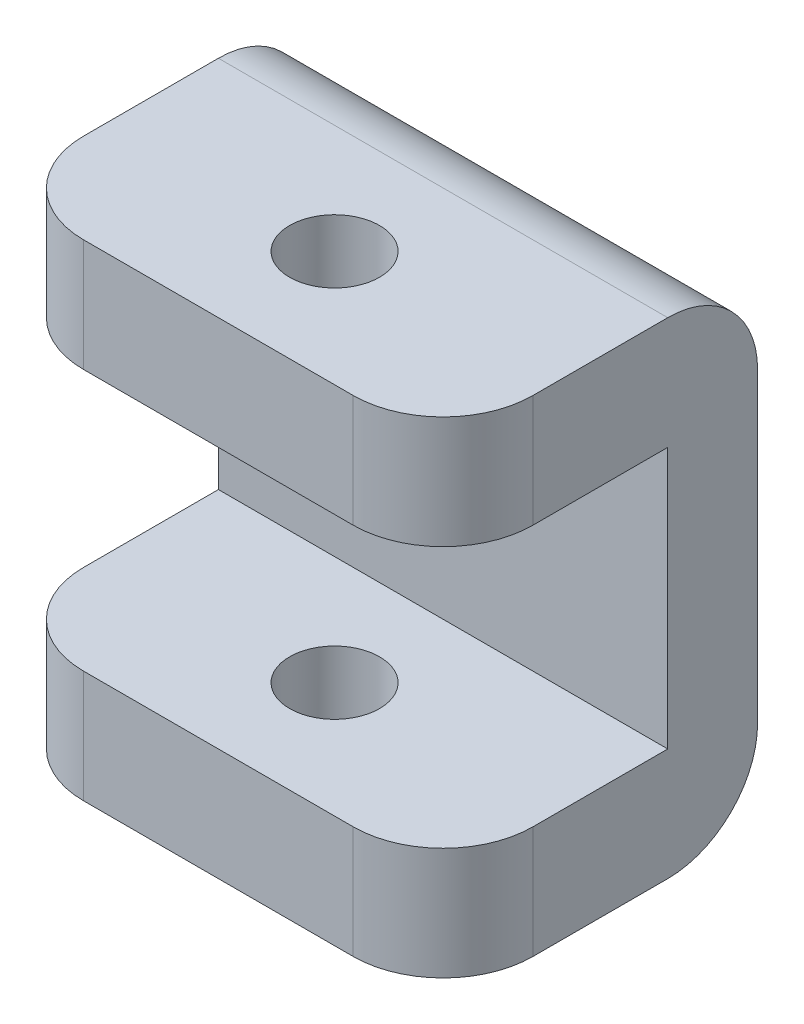
ISO-10303-21;
HEADER;
FILE_DESCRIPTION(('STEP AP214'),'2;1');
FILE_NAME('part.step','',(''),(''),'','','');
FILE_SCHEMA(('AUTOMOTIVE_DESIGN { 1 0 10303 214 1 1 1 1 }'));
ENDSEC;
DATA;
#1=APPLICATION_CONTEXT('core data for automotive mechanical design processes');
#2=APPLICATION_PROTOCOL_DEFINITION('international standard','automotive_design',2000,#1);
#3=PRODUCT_CONTEXT('',#1,'mechanical');
#4=PRODUCT('Part','Part','',(#3));
#5=PRODUCT_RELATED_PRODUCT_CATEGORY('part','',(#4));
#6=PRODUCT_DEFINITION_FORMATION('','',#4);
#7=PRODUCT_DEFINITION_CONTEXT('part definition',#1,'design');
#8=PRODUCT_DEFINITION('design','',#6,#7);
#9=PRODUCT_DEFINITION_SHAPE('','',#8);
#10=(LENGTH_UNIT() NAMED_UNIT(*) SI_UNIT(.MILLI.,.METRE.));
#11=(NAMED_UNIT(*) PLANE_ANGLE_UNIT() SI_UNIT($,.RADIAN.));
#12=(NAMED_UNIT(*) SI_UNIT($,.STERADIAN.) SOLID_ANGLE_UNIT());
#13=UNCERTAINTY_MEASURE_WITH_UNIT(LENGTH_MEASURE(1.E-05),#10,'distance_accuracy_value','');
#14=(GEOMETRIC_REPRESENTATION_CONTEXT(3) GLOBAL_UNCERTAINTY_ASSIGNED_CONTEXT((#13)) GLOBAL_UNIT_ASSIGNED_CONTEXT((#10,
#11,#12)) REPRESENTATION_CONTEXT('',''));
#15=CARTESIAN_POINT('',(0.,0.,0.));
#16=DIRECTION('',(0.,0.,1.));
#17=DIRECTION('',(1.,0.,0.));
#18=AXIS2_PLACEMENT_3D('',#15,#16,#17);
#19=CARTESIAN_POINT('',(0.,0.,2.));
#20=DIRECTION('',(0.,0.,1.));
#21=DIRECTION('',(1.,0.,0.));
#22=AXIS2_PLACEMENT_3D('',#19,#20,#21);
#23=PLANE('',#22);
#24=DIRECTION('',(0.,-1.,0.));
#25=VECTOR('',#24,1.);
#26=CARTESIAN_POINT('',(-8.33333333333333,3.93115942028985,2.));
#27=LINE('',#26,#25);
#28=CARTESIAN_POINT('',(-8.33333333333333,1.43115942028985,2.));
#29=VERTEX_POINT('',#28);
#30=CARTESIAN_POINT('',(-8.33333333333333,-4.38184057971015,2.));
#31=VERTEX_POINT('',#30);
#32=EDGE_CURVE('E164',#29,#31,#27,.T.);
#33=ORIENTED_EDGE('',*,*,#32,.T.);
#34=DIRECTION('',(-1.,0.,0.));
#35=VECTOR('',#34,1.);
#36=CARTESIAN_POINT('',(1.66666666666667,-4.38184057971015,2.));
#37=LINE('',#36,#35);
#38=CARTESIAN_POINT('',(1.66666666666667,-4.38184057971015,2.));
#39=VERTEX_POINT('',#38);
#40=EDGE_CURVE('E161',#39,#31,#37,.T.);
#41=ORIENTED_EDGE('',*,*,#40,.F.);
#42=DIRECTION('',(0.,1.,0.));
#43=VECTOR('',#42,1.);
#44=CARTESIAN_POINT('',(1.66666666666667,3.93115942028985,2.));
#45=LINE('',#44,#43);
#46=CARTESIAN_POINT('',(1.66666666666667,1.43115942028985,2.));
#47=VERTEX_POINT('',#46);
#48=EDGE_CURVE('E145',#39,#47,#45,.T.);
#49=ORIENTED_EDGE('',*,*,#48,.T.);
#50=DIRECTION('',(1.,0.,0.));
#51=VECTOR('',#50,1.);
#52=CARTESIAN_POINT('',(-8.33333333333333,1.43115942028985,2.));
#53=LINE('',#52,#51);
#54=EDGE_CURVE('E158',#29,#47,#53,.T.);
#55=ORIENTED_EDGE('',*,*,#54,.F.);
#56=EDGE_LOOP('',(#33,#41,#49,#55));
#57=FACE_BOUND('',#56,.T.);
#58=ADVANCED_FACE('F39',(#57),#23,.T.);
#59=CARTESIAN_POINT('',(-8.33333333333333,3.93115942028985,2.));
#60=DIRECTION('',(1.,0.,0.));
#61=DIRECTION('',(0.,1.,0.));
#62=AXIS2_PLACEMENT_3D('',#59,#60,#61);
#63=PLANE('',#62);
#64=DIRECTION('',(0.,-1.,0.));
#65=VECTOR('',#64,1.);
#66=CARTESIAN_POINT('',(-8.33333333333333,3.93115942028985,0.));
#67=LINE('',#66,#65);
#68=CARTESIAN_POINT('',(-8.33333333333333,1.93115942028985,0.));
#69=VERTEX_POINT('',#68);
#70=CARTESIAN_POINT('',(-8.33333333333333,-4.88184057971015,0.));
#71=VERTEX_POINT('',#70);
#72=EDGE_CURVE('E181',#69,#71,#67,.T.);
#73=ORIENTED_EDGE('',*,*,#72,.T.);
#74=CARTESIAN_POINT('',(-8.33333333333333,-4.88184057971015,2.));
#75=DIRECTION('',(1.,0.,0.));
#76=DIRECTION('',(0.,1.,0.));
#77=AXIS2_PLACEMENT_3D('',#74,#75,#76);
#78=CIRCLE('',#77,2.);
#79=CARTESIAN_POINT('',(-8.33333333333333,-6.88184057971015,2.));
#80=VERTEX_POINT('',#79);
#81=EDGE_CURVE('E247',#71,#80,#78,.F.);
#82=ORIENTED_EDGE('',*,*,#81,.T.);
#83=DIRECTION('',(0.,0.,-1.));
#84=VECTOR('',#83,1.);
#85=CARTESIAN_POINT('',(-8.33333333333333,-6.88184057971015,2.));
#86=LINE('',#85,#84);
#87=CARTESIAN_POINT('',(-8.33333333333333,-6.88184057971015,5.));
#88=VERTEX_POINT('',#87);
#89=EDGE_CURVE('E201',#88,#80,#86,.T.);
#90=ORIENTED_EDGE('',*,*,#89,.F.);
#91=DIRECTION('',(0.,-1.,0.));
#92=VECTOR('',#91,1.);
#93=CARTESIAN_POINT('',(-8.33333333333333,-4.38184057971015,5.));
#94=LINE('',#93,#92);
#95=CARTESIAN_POINT('',(-8.33333333333333,-4.38184057971015,5.));
#96=VERTEX_POINT('',#95);
#97=EDGE_CURVE('E241',#88,#96,#94,.F.);
#98=ORIENTED_EDGE('',*,*,#97,.T.);
#99=DIRECTION('',(0.,0.,-1.));
#100=VECTOR('',#99,1.);
#101=CARTESIAN_POINT('',(-8.33333333333333,-4.38184057971015,7.));
#102=LINE('',#101,#100);
#103=EDGE_CURVE('E175',#96,#31,#102,.T.);
#104=ORIENTED_EDGE('',*,*,#103,.T.);
#105=ORIENTED_EDGE('',*,*,#32,.F.);
#106=DIRECTION('',(0.,0.,-1.));
#107=VECTOR('',#106,1.);
#108=CARTESIAN_POINT('',(-8.33333333333333,1.43115942028985,7.));
#109=LINE('',#108,#107);
#110=CARTESIAN_POINT('',(-8.33333333333333,1.43115942028985,5.));
#111=VERTEX_POINT('',#110);
#112=EDGE_CURVE('E151',#111,#29,#109,.T.);
#113=ORIENTED_EDGE('',*,*,#112,.F.);
#114=DIRECTION('',(0.,-1.,0.));
#115=VECTOR('',#114,1.);
#116=CARTESIAN_POINT('',(-8.33333333333333,3.93115942028985,5.));
#117=LINE('',#116,#115);
#118=CARTESIAN_POINT('',(-8.33333333333333,3.93115942028985,5.));
#119=VERTEX_POINT('',#118);
#120=EDGE_CURVE('E238',#111,#119,#117,.F.);
#121=ORIENTED_EDGE('',*,*,#120,.T.);
#122=DIRECTION('',(0.,0.,-1.));
#123=VECTOR('',#122,1.);
#124=CARTESIAN_POINT('',(-8.33333333333333,3.93115942028985,2.));
#125=LINE('',#124,#123);
#126=CARTESIAN_POINT('',(-8.33333333333333,3.93115942028985,2.));
#127=VERTEX_POINT('',#126);
#128=EDGE_CURVE('E163',#119,#127,#125,.T.);
#129=ORIENTED_EDGE('',*,*,#128,.T.);
#130=CARTESIAN_POINT('',(-8.33333333333333,1.93115942028985,2.));
#131=DIRECTION('',(1.,0.,0.));
#132=DIRECTION('',(0.,1.,0.));
#133=AXIS2_PLACEMENT_3D('',#130,#131,#132);
#134=CIRCLE('',#133,2.);
#135=EDGE_CURVE('E244',#127,#69,#134,.F.);
#136=ORIENTED_EDGE('',*,*,#135,.T.);
#137=EDGE_LOOP('',(#73,#82,#90,#98,#104,#105,#113,#121,#129,#136));
#138=FACE_BOUND('',#137,.T.);
#139=ADVANCED_FACE('F282',(#138),#63,.F.);
#140=CARTESIAN_POINT('',(-8.33333333333333,-6.88184057971015,2.));
#141=DIRECTION('',(0.,1.,0.));
#142=DIRECTION('',(0.,0.,1.));
#143=AXIS2_PLACEMENT_3D('',#140,#141,#142);
#144=PLANE('',#143);
#145=CARTESIAN_POINT('',(-3.31858433429488,-6.88184057971015,4.43));
#146=DIRECTION('',(0.,1.,0.));
#147=DIRECTION('',(0.,0.,1.));
#148=AXIS2_PLACEMENT_3D('',#145,#146,#147);
#149=CIRCLE('',#148,1.);
#150=CARTESIAN_POINT('',(-3.31858433429488,-6.88184057971015,5.43));
#151=VERTEX_POINT('',#150);
#152=EDGE_CURVE('E211',#151,#151,#149,.T.);
#153=ORIENTED_EDGE('',*,*,#152,.T.);
#154=EDGE_LOOP('',(#153));
#155=FACE_BOUND('',#154,.T.);
#156=ORIENTED_EDGE('',*,*,#89,.T.);
#157=DIRECTION('',(1.,0.,0.));
#158=VECTOR('',#157,1.);
#159=CARTESIAN_POINT('',(-8.33333333333333,-6.88184057971015,2.));
#160=LINE('',#159,#158);
#161=CARTESIAN_POINT('',(1.66666666666667,-6.88184057971015,2.));
#162=VERTEX_POINT('',#161);
#163=EDGE_CURVE('E217',#80,#162,#160,.T.);
#164=ORIENTED_EDGE('',*,*,#163,.T.);
#165=DIRECTION('',(0.,0.,-1.));
#166=VECTOR('',#165,1.);
#167=CARTESIAN_POINT('',(1.66666666666667,-6.88184057971015,2.));
#168=LINE('',#167,#166);
#169=CARTESIAN_POINT('',(1.66666666666667,-6.88184057971015,5.));
#170=VERTEX_POINT('',#169);
#171=EDGE_CURVE('E198',#170,#162,#168,.T.);
#172=ORIENTED_EDGE('',*,*,#171,.F.);
#173=CARTESIAN_POINT('',(-0.333333333333331,-6.88184057971015,5.));
#174=DIRECTION('',(0.,1.,0.));
#175=DIRECTION('',(0.,0.,1.));
#176=AXIS2_PLACEMENT_3D('',#173,#174,#175);
#177=CIRCLE('',#176,2.);
#178=CARTESIAN_POINT('',(-0.333333333333331,-6.88184057971015,7.));
#179=VERTEX_POINT('',#178);
#180=EDGE_CURVE('E205',#170,#179,#177,.F.);
#181=ORIENTED_EDGE('',*,*,#180,.T.);
#182=DIRECTION('',(1.,0.,0.));
#183=VECTOR('',#182,1.);
#184=CARTESIAN_POINT('',(1.66666666666667,-6.88184057971015,7.));
#185=LINE('',#184,#183);
#186=CARTESIAN_POINT('',(-6.33333333333333,-6.88184057971015,7.));
#187=VERTEX_POINT('',#186);
#188=EDGE_CURVE('E316',#187,#179,#185,.T.);
#189=ORIENTED_EDGE('',*,*,#188,.F.);
#190=CARTESIAN_POINT('',(-6.33333333333333,-6.88184057971015,5.));
#191=DIRECTION('',(0.,1.,0.));
#192=DIRECTION('',(0.,0.,1.));
#193=AXIS2_PLACEMENT_3D('',#190,#191,#192);
#194=CIRCLE('',#193,2.);
#195=EDGE_CURVE('E214',#187,#88,#194,.F.);
#196=ORIENTED_EDGE('',*,*,#195,.T.);
#197=EDGE_LOOP('',(#156,#164,#172,#181,#189,#196));
#198=FACE_BOUND('',#197,.T.);
#199=ADVANCED_FACE('F312',(#155,#198),#144,.F.);
#200=CARTESIAN_POINT('',(1.66666666666667,3.93115942028985,2.));
#201=DIRECTION('',(-1.,0.,0.));
#202=DIRECTION('',(0.,-1.,0.));
#203=AXIS2_PLACEMENT_3D('',#200,#201,#202);
#204=PLANE('',#203);
#205=ORIENTED_EDGE('',*,*,#171,.T.);
#206=CARTESIAN_POINT('',(1.66666666666667,-4.88184057971015,2.));
#207=DIRECTION('',(-1.,0.,0.));
#208=DIRECTION('',(0.,-1.,0.));
#209=AXIS2_PLACEMENT_3D('',#206,#207,#208);
#210=CIRCLE('',#209,2.);
#211=CARTESIAN_POINT('',(1.66666666666667,-4.88184057971015,0.));
#212=VERTEX_POINT('',#211);
#213=EDGE_CURVE('E229',#162,#212,#210,.F.);
#214=ORIENTED_EDGE('',*,*,#213,.T.);
#215=DIRECTION('',(0.,1.,0.));
#216=VECTOR('',#215,1.);
#217=CARTESIAN_POINT('',(1.66666666666667,3.93115942028985,0.));
#218=LINE('',#217,#216);
#219=CARTESIAN_POINT('',(1.66666666666667,1.93115942028985,0.));
#220=VERTEX_POINT('',#219);
#221=EDGE_CURVE('E183',#212,#220,#218,.T.);
#222=ORIENTED_EDGE('',*,*,#221,.T.);
#223=CARTESIAN_POINT('',(1.66666666666667,1.93115942028985,2.));
#224=DIRECTION('',(-1.,0.,0.));
#225=DIRECTION('',(0.,-1.,0.));
#226=AXIS2_PLACEMENT_3D('',#223,#224,#225);
#227=CIRCLE('',#226,2.);
#228=CARTESIAN_POINT('',(1.66666666666667,3.93115942028985,2.));
#229=VERTEX_POINT('',#228);
#230=EDGE_CURVE('E226',#220,#229,#227,.F.);
#231=ORIENTED_EDGE('',*,*,#230,.T.);
#232=DIRECTION('',(0.,0.,-1.));
#233=VECTOR('',#232,1.);
#234=CARTESIAN_POINT('',(1.66666666666667,3.93115942028985,2.));
#235=LINE('',#234,#233);
#236=CARTESIAN_POINT('',(1.66666666666667,3.93115942028985,5.));
#237=VERTEX_POINT('',#236);
#238=EDGE_CURVE('E194',#237,#229,#235,.T.);
#239=ORIENTED_EDGE('',*,*,#238,.F.);
#240=DIRECTION('',(0.,1.,0.));
#241=VECTOR('',#240,1.);
#242=CARTESIAN_POINT('',(1.66666666666667,1.43115942028985,5.));
#243=LINE('',#242,#241);
#244=CARTESIAN_POINT('',(1.66666666666667,1.43115942028985,5.));
#245=VERTEX_POINT('',#244);
#246=EDGE_CURVE('E148',#237,#245,#243,.F.);
#247=ORIENTED_EDGE('',*,*,#246,.T.);
#248=DIRECTION('',(0.,0.,-1.));
#249=VECTOR('',#248,1.);
#250=CARTESIAN_POINT('',(1.66666666666667,1.43115942028985,7.));
#251=LINE('',#250,#249);
#252=EDGE_CURVE('E140',#245,#47,#251,.T.);
#253=ORIENTED_EDGE('',*,*,#252,.T.);
#254=ORIENTED_EDGE('',*,*,#48,.F.);
#255=DIRECTION('',(0.,0.,-1.));
#256=VECTOR('',#255,1.);
#257=CARTESIAN_POINT('',(1.66666666666667,-4.38184057971015,7.));
#258=LINE('',#257,#256);
#259=CARTESIAN_POINT('',(1.66666666666667,-4.38184057971015,5.));
#260=VERTEX_POINT('',#259);
#261=EDGE_CURVE('E170',#260,#39,#258,.T.);
#262=ORIENTED_EDGE('',*,*,#261,.F.);
#263=DIRECTION('',(0.,1.,0.));
#264=VECTOR('',#263,1.);
#265=CARTESIAN_POINT('',(1.66666666666667,-6.88184057971015,5.));
#266=LINE('',#265,#264);
#267=EDGE_CURVE('E223',#260,#170,#266,.F.);
#268=ORIENTED_EDGE('',*,*,#267,.T.);
#269=EDGE_LOOP('',(#205,#214,#222,#231,#239,#247,#253,#254,#262,#268));
#270=FACE_BOUND('',#269,.T.);
#271=ADVANCED_FACE('F143',(#270),#204,.F.);
#272=CARTESIAN_POINT('',(-8.33333333333333,3.93115942028985,2.));
#273=DIRECTION('',(0.,-1.,0.));
#274=DIRECTION('',(0.,0.,-1.));
#275=AXIS2_PLACEMENT_3D('',#272,#273,#274);
#276=PLANE('',#275);
#277=CARTESIAN_POINT('',(-3.31858433429488,3.93115942028985,4.43));
#278=DIRECTION('',(0.,1.,0.));
#279=DIRECTION('',(0.,0.,1.));
#280=AXIS2_PLACEMENT_3D('',#277,#278,#279);
#281=CIRCLE('',#280,1.);
#282=CARTESIAN_POINT('',(-3.31858433429488,3.93115942028985,5.43));
#283=VERTEX_POINT('',#282);
#284=EDGE_CURVE('E518',#283,#283,#281,.T.);
#285=ORIENTED_EDGE('',*,*,#284,.F.);
#286=EDGE_LOOP('',(#285));
#287=FACE_BOUND('',#286,.T.);
#288=ORIENTED_EDGE('',*,*,#238,.T.);
#289=DIRECTION('',(-1.,0.,0.));
#290=VECTOR('',#289,1.);
#291=CARTESIAN_POINT('',(-8.33333333333333,3.93115942028985,2.));
#292=LINE('',#291,#290);
#293=EDGE_CURVE('E256',#229,#127,#292,.T.);
#294=ORIENTED_EDGE('',*,*,#293,.T.);
#295=ORIENTED_EDGE('',*,*,#128,.F.);
#296=CARTESIAN_POINT('',(-6.33333333333333,3.93115942028985,5.));
#297=DIRECTION('',(0.,-1.,0.));
#298=DIRECTION('',(0.,0.,-1.));
#299=AXIS2_PLACEMENT_3D('',#296,#297,#298);
#300=CIRCLE('',#299,2.);
#301=CARTESIAN_POINT('',(-6.33333333333333,3.93115942028985,7.));
#302=VERTEX_POINT('',#301);
#303=EDGE_CURVE('E250',#119,#302,#300,.F.);
#304=ORIENTED_EDGE('',*,*,#303,.T.);
#305=DIRECTION('',(-1.,0.,0.));
#306=VECTOR('',#305,1.);
#307=CARTESIAN_POINT('',(-8.33333333333333,3.93115942028985,7.));
#308=LINE('',#307,#306);
#309=CARTESIAN_POINT('',(-0.333333333333335,3.93115942028985,7.));
#310=VERTEX_POINT('',#309);
#311=EDGE_CURVE('E152',#310,#302,#308,.T.);
#312=ORIENTED_EDGE('',*,*,#311,.F.);
#313=CARTESIAN_POINT('',(-0.333333333333334,3.93115942028985,5.));
#314=DIRECTION('',(0.,-1.,0.));
#315=DIRECTION('',(0.,0.,-1.));
#316=AXIS2_PLACEMENT_3D('',#313,#314,#315);
#317=CIRCLE('',#316,2.);
#318=EDGE_CURVE('E253',#310,#237,#317,.F.);
#319=ORIENTED_EDGE('',*,*,#318,.T.);
#320=EDGE_LOOP('',(#288,#294,#295,#304,#312,#319));
#321=FACE_BOUND('',#320,.T.);
#322=ADVANCED_FACE('F288',(#287,#321),#276,.F.);
#323=CARTESIAN_POINT('',(0.,0.,0.));
#324=DIRECTION('',(0.,0.,1.));
#325=DIRECTION('',(1.,0.,0.));
#326=AXIS2_PLACEMENT_3D('',#323,#324,#325);
#327=PLANE('',#326);
#328=ORIENTED_EDGE('',*,*,#221,.F.);
#329=DIRECTION('',(1.,0.,0.));
#330=VECTOR('',#329,1.);
#331=CARTESIAN_POINT('',(0.,-4.88184057971015,0.));
#332=LINE('',#331,#330);
#333=EDGE_CURVE('E235',#212,#71,#332,.F.);
#334=ORIENTED_EDGE('',*,*,#333,.T.);
#335=ORIENTED_EDGE('',*,*,#72,.F.);
#336=DIRECTION('',(-1.,0.,0.));
#337=VECTOR('',#336,1.);
#338=CARTESIAN_POINT('',(0.,1.93115942028985,0.));
#339=LINE('',#338,#337);
#340=EDGE_CURVE('E232',#69,#220,#339,.F.);
#341=ORIENTED_EDGE('',*,*,#340,.T.);
#342=EDGE_LOOP('',(#328,#334,#335,#341));
#343=FACE_BOUND('',#342,.T.);
#344=ADVANCED_FACE('F304',(#343),#327,.F.);
#345=CARTESIAN_POINT('',(-8.33333333333333,1.43115942028985,7.));
#346=DIRECTION('',(0.,1.,0.));
#347=DIRECTION('',(-1.,0.,0.));
#348=AXIS2_PLACEMENT_3D('',#345,#346,#347);
#349=PLANE('',#348);
#350=CARTESIAN_POINT('',(-3.31858433429488,1.43115942028985,4.43));
#351=DIRECTION('',(0.,1.,0.));
#352=DIRECTION('',(-1.,0.,0.));
#353=AXIS2_PLACEMENT_3D('',#350,#351,#352);
#354=CIRCLE('',#353,1.);
#355=CARTESIAN_POINT('',(-4.31858433429488,1.43115942028985,4.43));
#356=VERTEX_POINT('',#355);
#357=EDGE_CURVE('E210',#356,#356,#354,.T.);
#358=ORIENTED_EDGE('',*,*,#357,.T.);
#359=EDGE_LOOP('',(#358));
#360=FACE_BOUND('',#359,.T.);
#361=ORIENTED_EDGE('',*,*,#252,.F.);
#362=CARTESIAN_POINT('',(-0.333333333333334,1.43115942028985,5.));
#363=DIRECTION('',(0.,1.,0.));
#364=DIRECTION('',(-1.,0.,0.));
#365=AXIS2_PLACEMENT_3D('',#362,#363,#364);
#366=CIRCLE('',#365,2.);
#367=CARTESIAN_POINT('',(-0.333333333333333,1.43115942028985,7.));
#368=VERTEX_POINT('',#367);
#369=EDGE_CURVE('E11',#245,#368,#366,.F.);
#370=ORIENTED_EDGE('',*,*,#369,.T.);
#371=DIRECTION('',(1.,0.,0.));
#372=VECTOR('',#371,1.);
#373=CARTESIAN_POINT('',(-8.33333333333333,1.43115942028985,7.));
#374=LINE('',#373,#372);
#375=CARTESIAN_POINT('',(-6.33333333333333,1.43115942028985,7.));
#376=VERTEX_POINT('',#375);
#377=EDGE_CURVE('E169',#376,#368,#374,.T.);
#378=ORIENTED_EDGE('',*,*,#377,.F.);
#379=CARTESIAN_POINT('',(-6.33333333333333,1.43115942028985,5.));
#380=DIRECTION('',(0.,1.,0.));
#381=DIRECTION('',(-1.,0.,0.));
#382=AXIS2_PLACEMENT_3D('',#379,#380,#381);
#383=CIRCLE('',#382,2.);
#384=EDGE_CURVE('E48',#376,#111,#383,.F.);
#385=ORIENTED_EDGE('',*,*,#384,.T.);
#386=ORIENTED_EDGE('',*,*,#112,.T.);
#387=ORIENTED_EDGE('',*,*,#54,.T.);
#388=EDGE_LOOP('',(#361,#370,#378,#385,#386,#387));
#389=FACE_BOUND('',#388,.T.);
#390=ADVANCED_FACE('F166',(#360,#389),#349,.F.);
#391=CARTESIAN_POINT('',(0.,0.,7.));
#392=DIRECTION('',(0.,0.,1.));
#393=DIRECTION('',(1.,0.,0.));
#394=AXIS2_PLACEMENT_3D('',#391,#392,#393);
#395=PLANE('',#394);
#396=ORIENTED_EDGE('',*,*,#377,.T.);
#397=DIRECTION('',(0.,1.,0.));
#398=VECTOR('',#397,1.);
#399=CARTESIAN_POINT('',(-0.333333333333334,3.93115942028985,7.));
#400=LINE('',#399,#398);
#401=EDGE_CURVE('E277',#368,#310,#400,.T.);
#402=ORIENTED_EDGE('',*,*,#401,.T.);
#403=ORIENTED_EDGE('',*,*,#311,.T.);
#404=DIRECTION('',(0.,-1.,0.));
#405=VECTOR('',#404,1.);
#406=CARTESIAN_POINT('',(-6.33333333333333,1.43115942028985,7.));
#407=LINE('',#406,#405);
#408=EDGE_CURVE('E274',#302,#376,#407,.T.);
#409=ORIENTED_EDGE('',*,*,#408,.T.);
#410=EDGE_LOOP('',(#396,#402,#403,#409));
#411=FACE_BOUND('',#410,.T.);
#412=ADVANCED_FACE('F290',(#411),#395,.T.);
#413=CARTESIAN_POINT('',(1.66666666666667,-4.38184057971015,7.));
#414=DIRECTION('',(0.,-1.,0.));
#415=DIRECTION('',(1.,0.,0.));
#416=AXIS2_PLACEMENT_3D('',#413,#414,#415);
#417=PLANE('',#416);
#418=CARTESIAN_POINT('',(-3.31858433429488,-4.38184057971015,4.43));
#419=DIRECTION('',(0.,-1.,0.));
#420=DIRECTION('',(1.,0.,0.));
#421=AXIS2_PLACEMENT_3D('',#418,#419,#420);
#422=CIRCLE('',#421,1.);
#423=CARTESIAN_POINT('',(-2.31858433429488,-4.38184057971015,4.43));
#424=VERTEX_POINT('',#423);
#425=EDGE_CURVE('E206',#424,#424,#422,.T.);
#426=ORIENTED_EDGE('',*,*,#425,.T.);
#427=EDGE_LOOP('',(#426));
#428=FACE_BOUND('',#427,.T.);
#429=ORIENTED_EDGE('',*,*,#103,.F.);
#430=CARTESIAN_POINT('',(-6.33333333333333,-4.38184057971015,5.));
#431=DIRECTION('',(0.,-1.,0.));
#432=DIRECTION('',(1.,0.,0.));
#433=AXIS2_PLACEMENT_3D('',#430,#431,#432);
#434=CIRCLE('',#433,2.);
#435=CARTESIAN_POINT('',(-6.33333333333333,-4.38184057971015,7.));
#436=VERTEX_POINT('',#435);
#437=EDGE_CURVE('E271',#96,#436,#434,.F.);
#438=ORIENTED_EDGE('',*,*,#437,.T.);
#439=DIRECTION('',(-1.,0.,0.));
#440=VECTOR('',#439,1.);
#441=CARTESIAN_POINT('',(1.66666666666667,-4.38184057971015,7.));
#442=LINE('',#441,#440);
#443=CARTESIAN_POINT('',(-0.333333333333332,-4.38184057971015,7.));
#444=VERTEX_POINT('',#443);
#445=EDGE_CURVE('E326',#444,#436,#442,.T.);
#446=ORIENTED_EDGE('',*,*,#445,.F.);
#447=CARTESIAN_POINT('',(-0.333333333333332,-4.38184057971015,5.));
#448=DIRECTION('',(0.,-1.,0.));
#449=DIRECTION('',(1.,0.,0.));
#450=AXIS2_PLACEMENT_3D('',#447,#448,#449);
#451=CIRCLE('',#450,2.);
#452=EDGE_CURVE('E268',#444,#260,#451,.F.);
#453=ORIENTED_EDGE('',*,*,#452,.T.);
#454=ORIENTED_EDGE('',*,*,#261,.T.);
#455=ORIENTED_EDGE('',*,*,#40,.T.);
#456=EDGE_LOOP('',(#429,#438,#446,#453,#454,#455));
#457=FACE_BOUND('',#456,.T.);
#458=ADVANCED_FACE('F339',(#428,#457),#417,.F.);
#459=CARTESIAN_POINT('',(0.,0.,7.));
#460=DIRECTION('',(0.,0.,1.));
#461=DIRECTION('',(1.,0.,0.));
#462=AXIS2_PLACEMENT_3D('',#459,#460,#461);
#463=PLANE('',#462);
#464=ORIENTED_EDGE('',*,*,#445,.T.);
#465=DIRECTION('',(0.,-1.,0.));
#466=VECTOR('',#465,1.);
#467=CARTESIAN_POINT('',(-6.33333333333333,-6.88184057971015,7.));
#468=LINE('',#467,#466);
#469=EDGE_CURVE('E264',#436,#187,#468,.T.);
#470=ORIENTED_EDGE('',*,*,#469,.T.);
#471=ORIENTED_EDGE('',*,*,#188,.T.);
#472=DIRECTION('',(0.,1.,0.));
#473=VECTOR('',#472,1.);
#474=CARTESIAN_POINT('',(-0.333333333333332,-4.38184057971015,7.));
#475=LINE('',#474,#473);
#476=EDGE_CURVE('E260',#179,#444,#475,.T.);
#477=ORIENTED_EDGE('',*,*,#476,.T.);
#478=EDGE_LOOP('',(#464,#470,#471,#477));
#479=FACE_BOUND('',#478,.T.);
#480=ADVANCED_FACE('F323',(#479),#463,.T.);
#481=CARTESIAN_POINT('',(-3.31858433429488,-6.88184057971015,4.43));
#482=DIRECTION('',(0.,1.,0.));
#483=DIRECTION('',(0.,0.,1.));
#484=AXIS2_PLACEMENT_3D('',#481,#482,#483);
#485=CYLINDRICAL_SURFACE('',#484,1.);
#486=ORIENTED_EDGE('',*,*,#152,.F.);
#487=EDGE_LOOP('',(#486));
#488=FACE_BOUND('',#487,.T.);
#489=ORIENTED_EDGE('',*,*,#425,.F.);
#490=EDGE_LOOP('',(#489));
#491=FACE_BOUND('',#490,.T.);
#492=ADVANCED_FACE('F416',(#488,#491),#485,.F.);
#493=ORIENTED_EDGE('',*,*,#284,.T.);
#494=EDGE_LOOP('',(#493));
#495=FACE_BOUND('',#494,.T.);
#496=ORIENTED_EDGE('',*,*,#357,.F.);
#497=EDGE_LOOP('',(#496));
#498=FACE_BOUND('',#497,.T.);
#499=ADVANCED_FACE('F372',(#495,#498),#485,.F.);
#500=CARTESIAN_POINT('',(-8.33333333333333,-4.88184057971015,2.));
#501=DIRECTION('',(1.,0.,0.));
#502=DIRECTION('',(0.,0.,-1.));
#503=AXIS2_PLACEMENT_3D('',#500,#501,#502);
#504=CYLINDRICAL_SURFACE('',#503,2.);
#505=ORIENTED_EDGE('',*,*,#81,.F.);
#506=ORIENTED_EDGE('',*,*,#333,.F.);
#507=ORIENTED_EDGE('',*,*,#213,.F.);
#508=ORIENTED_EDGE('',*,*,#163,.F.);
#509=EDGE_LOOP('',(#505,#506,#507,#508));
#510=FACE_BOUND('',#509,.T.);
#511=ADVANCED_FACE('F307',(#510),#504,.T.);
#512=CARTESIAN_POINT('',(-8.33333333333333,1.93115942028985,2.));
#513=DIRECTION('',(-1.,0.,0.));
#514=DIRECTION('',(0.,0.,1.));
#515=AXIS2_PLACEMENT_3D('',#512,#513,#514);
#516=CYLINDRICAL_SURFACE('',#515,2.);
#517=ORIENTED_EDGE('',*,*,#230,.F.);
#518=ORIENTED_EDGE('',*,*,#340,.F.);
#519=ORIENTED_EDGE('',*,*,#135,.F.);
#520=ORIENTED_EDGE('',*,*,#293,.F.);
#521=EDGE_LOOP('',(#517,#518,#519,#520));
#522=FACE_BOUND('',#521,.T.);
#523=ADVANCED_FACE('F300',(#522),#516,.T.);
#524=CARTESIAN_POINT('',(-6.33333333333333,0.,5.));
#525=DIRECTION('',(0.,1.,0.));
#526=DIRECTION('',(-1.,0.,0.));
#527=AXIS2_PLACEMENT_3D('',#524,#525,#526);
#528=CYLINDRICAL_SURFACE('',#527,2.);
#529=ORIENTED_EDGE('',*,*,#437,.F.);
#530=ORIENTED_EDGE('',*,*,#97,.F.);
#531=ORIENTED_EDGE('',*,*,#195,.F.);
#532=ORIENTED_EDGE('',*,*,#469,.F.);
#533=EDGE_LOOP('',(#529,#530,#531,#532));
#534=FACE_BOUND('',#533,.T.);
#535=ADVANCED_FACE('F320',(#534),#528,.T.);
#536=CARTESIAN_POINT('',(-0.333333333333333,0.,5.));
#537=DIRECTION('',(0.,-1.,0.));
#538=DIRECTION('',(1.,0.,0.));
#539=AXIS2_PLACEMENT_3D('',#536,#537,#538);
#540=CYLINDRICAL_SURFACE('',#539,2.);
#541=ORIENTED_EDGE('',*,*,#180,.F.);
#542=ORIENTED_EDGE('',*,*,#267,.F.);
#543=ORIENTED_EDGE('',*,*,#452,.F.);
#544=ORIENTED_EDGE('',*,*,#476,.F.);
#545=EDGE_LOOP('',(#541,#542,#543,#544));
#546=FACE_BOUND('',#545,.T.);
#547=ADVANCED_FACE('F343',(#546),#540,.T.);
#548=CARTESIAN_POINT('',(-0.333333333333333,0.,5.));
#549=DIRECTION('',(0.,-1.,0.));
#550=DIRECTION('',(1.,0.,0.));
#551=AXIS2_PLACEMENT_3D('',#548,#549,#550);
#552=CYLINDRICAL_SURFACE('',#551,2.);
#553=ORIENTED_EDGE('',*,*,#369,.F.);
#554=ORIENTED_EDGE('',*,*,#246,.F.);
#555=ORIENTED_EDGE('',*,*,#318,.F.);
#556=ORIENTED_EDGE('',*,*,#401,.F.);
#557=EDGE_LOOP('',(#553,#554,#555,#556));
#558=FACE_BOUND('',#557,.T.);
#559=ADVANCED_FACE('F294',(#558),#552,.T.);
#560=CARTESIAN_POINT('',(-6.33333333333333,0.,5.));
#561=DIRECTION('',(0.,1.,0.));
#562=DIRECTION('',(-1.,0.,0.));
#563=AXIS2_PLACEMENT_3D('',#560,#561,#562);
#564=CYLINDRICAL_SURFACE('',#563,2.);
#565=ORIENTED_EDGE('',*,*,#303,.F.);
#566=ORIENTED_EDGE('',*,*,#120,.F.);
#567=ORIENTED_EDGE('',*,*,#384,.F.);
#568=ORIENTED_EDGE('',*,*,#408,.F.);
#569=EDGE_LOOP('',(#565,#566,#567,#568));
#570=FACE_BOUND('',#569,.T.);
#571=ADVANCED_FACE('F41',(#570),#564,.T.);
#572=CLOSED_SHELL('',(#58,#139,#199,#271,#322,#344,#390,#412,#458,#480,#492,#499,#511,#523,#535,
#547,#559,#571));
#573=MANIFOLD_SOLID_BREP('B2',#572);
#574=ADVANCED_BREP_SHAPE_REPRESENTATION('',(#18,#573),#14);
#575=SHAPE_DEFINITION_REPRESENTATION(#9,#574);
ENDSEC;
END-ISO-10303-21;
